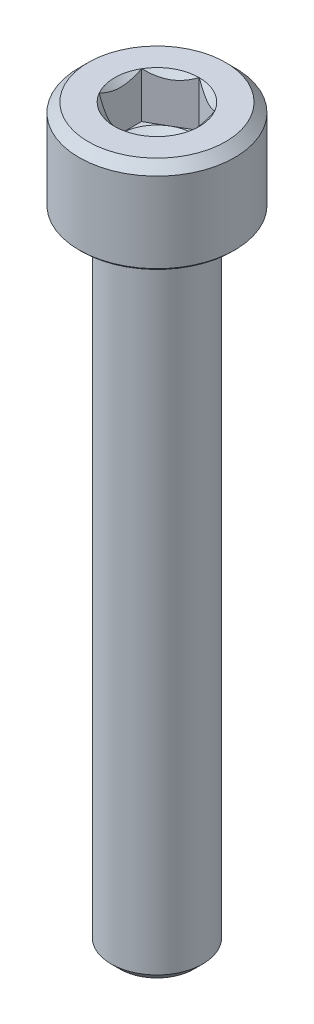
ISO-10303-21;
HEADER;
FILE_DESCRIPTION(('STEP AP214'),'2;1');
FILE_NAME('part.step','',(''),(''),'','','');
FILE_SCHEMA(('AUTOMOTIVE_DESIGN { 1 0 10303 214 1 1 1 1 }'));
ENDSEC;
DATA;
#1=APPLICATION_CONTEXT('core data for automotive mechanical design processes');
#2=APPLICATION_PROTOCOL_DEFINITION('international standard','automotive_design',2000,#1);
#3=PRODUCT_CONTEXT('',#1,'mechanical');
#4=PRODUCT('Part','Part','',(#3));
#5=PRODUCT_RELATED_PRODUCT_CATEGORY('part','',(#4));
#6=PRODUCT_DEFINITION_FORMATION('','',#4);
#7=PRODUCT_DEFINITION_CONTEXT('part definition',#1,'design');
#8=PRODUCT_DEFINITION('design','',#6,#7);
#9=PRODUCT_DEFINITION_SHAPE('','',#8);
#10=(LENGTH_UNIT() NAMED_UNIT(*) SI_UNIT(.MILLI.,.METRE.));
#11=(NAMED_UNIT(*) PLANE_ANGLE_UNIT() SI_UNIT($,.RADIAN.));
#12=(NAMED_UNIT(*) SI_UNIT($,.STERADIAN.) SOLID_ANGLE_UNIT());
#13=UNCERTAINTY_MEASURE_WITH_UNIT(LENGTH_MEASURE(1.E-05),#10,'distance_accuracy_value','');
#14=(GEOMETRIC_REPRESENTATION_CONTEXT(3) GLOBAL_UNCERTAINTY_ASSIGNED_CONTEXT((#13)) GLOBAL_UNIT_ASSIGNED_CONTEXT((#10,
#11,#12)) REPRESENTATION_CONTEXT('',''));
#15=CARTESIAN_POINT('',(0.,0.,0.));
#16=DIRECTION('',(0.,0.,1.));
#17=DIRECTION('',(1.,0.,0.));
#18=AXIS2_PLACEMENT_3D('',#15,#16,#17);
#19=CARTESIAN_POINT('',(0.,5.,0.));
#20=DIRECTION('',(0.,1.,0.));
#21=DIRECTION('',(0.,0.,1.));
#22=AXIS2_PLACEMENT_3D('',#19,#20,#21);
#23=CONICAL_SURFACE('',#22,2.3094010767585,0.785398163397454);
#24=CARTESIAN_POINT('',(0.,5.,0.));
#25=DIRECTION('',(0.,1.,0.));
#26=DIRECTION('',(0.,0.,1.));
#27=AXIS2_PLACEMENT_3D('',#24,#25,#26);
#28=CIRCLE('',#27,2.3094010767585);
#29=CARTESIAN_POINT('',(-2.,5.,-1.1547005383793));
#30=VERTEX_POINT('',#29);
#31=CARTESIAN_POINT('',(-1.99999999999995,5.,1.15470053837933));
#32=VERTEX_POINT('',#31);
#33=EDGE_CURVE('E247',#30,#32,#28,.T.);
#34=ORIENTED_EDGE('',*,*,#33,.T.);
#35=CARTESIAN_POINT('',(-2.,6.708654995211,3.48493537924179));
#36=CARTESIAN_POINT('',(-2.,6.61927874799562,3.38184597960107));
#37=CARTESIAN_POINT('',(-2.,6.53042050100161,3.27829801866237));
#38=CARTESIAN_POINT('',(-2.,6.35410938767823,3.06992943838187));
#39=CARTESIAN_POINT('',(-2.,6.26665721016997,2.96510823693146));
#40=CARTESIAN_POINT('',(-2.,6.09162252246028,2.75150553836105));
#41=CARTESIAN_POINT('',(-2.,6.00408331853335,2.64268841410051));
#42=CARTESIAN_POINT('',(-2.,5.83166422486033,2.4230012519306));
#43=CARTESIAN_POINT('',(-2.,5.74678367399898,2.31213173546714));
#44=CARTESIAN_POINT('',(-2.,5.58057752677808,2.08751128165371));
#45=CARTESIAN_POINT('',(-2.,5.49925685260331,1.97375667808639));
#46=CARTESIAN_POINT('',(-2.,5.34184669326608,1.7425008854525));
#47=CARTESIAN_POINT('',(-2.,5.26576149836544,1.6249967365224));
#48=CARTESIAN_POINT('',(-2.,5.12208771836077,1.38607583721063));
#49=CARTESIAN_POINT('',(-2.,5.05443808556477,1.26469628611464));
#50=CARTESIAN_POINT('',(-2.,4.93125075275312,1.01594779490901));
#51=CARTESIAN_POINT('',(-2.,4.8756907681709,0.888590409780953));
#52=CARTESIAN_POINT('',(-2.,4.8057129725002,0.691083080219567));
#53=CARTESIAN_POINT('',(-2.,4.78445360220782,0.623368585918429));
#54=CARTESIAN_POINT('',(-2.,4.74782417137951,0.486345144048254));
#55=CARTESIAN_POINT('',(-2.,4.73245317082739,0.417036452850191));
#56=CARTESIAN_POINT('',(-2.,4.70862178314111,0.277659447369558));
#57=CARTESIAN_POINT('',(-2.,4.70011930731512,0.207598466966292));
#58=CARTESIAN_POINT('',(-2.,4.69049074221897,0.0669670350323962));
#59=CARTESIAN_POINT('',(-2.,4.68936387797234,-0.00360336219227659));
#60=CARTESIAN_POINT('',(-2.,4.69457684389319,-0.144553783114265));
#61=CARTESIAN_POINT('',(-2.,4.70092642398598,-0.214933437991882));
#62=CARTESIAN_POINT('',(-2.,4.72062790275546,-0.354698452121302));
#63=CARTESIAN_POINT('',(-2.,4.7339811803942,-0.424083612801754));
#64=CARTESIAN_POINT('',(-2.,4.76693306790518,-0.561849214257668));
#65=CARTESIAN_POINT('',(-2.,4.78657533412026,-0.630219027882887));
#66=CARTESIAN_POINT('',(-2.,4.83104362393445,-0.765224928840642));
#67=CARTESIAN_POINT('',(-2.,4.8558697049865,-0.831860996948626));
#68=CARTESIAN_POINT('',(-2.,4.91579733674522,-0.978223263821352));
#69=CARTESIAN_POINT('',(-2.,4.9519536536689,-1.05751393733752));
#70=CARTESIAN_POINT('',(-2.,5.02908857554944,-1.2137342544637));
#71=CARTESIAN_POINT('',(-2.,5.07006996654335,-1.29066250134976));
#72=CARTESIAN_POINT('',(-2.,5.1557834307896,-1.44259332598893));
#73=CARTESIAN_POINT('',(-2.,5.20052309801058,-1.51759158443137));
#74=CARTESIAN_POINT('',(-2.,5.292817103323,-1.66580274517424));
#75=CARTESIAN_POINT('',(-2.,5.34037088158701,-1.73901599851138));
#76=CARTESIAN_POINT('',(-2.,5.43793273052157,-1.8843458006077));
#77=CARTESIAN_POINT('',(-2.,5.48795248279134,-1.95645447101702));
#78=CARTESIAN_POINT('',(-2.,5.58974868867924,-2.09942399496152));
#79=CARTESIAN_POINT('',(-2.,5.64152527469541,-2.17028475383792));
#80=CARTESIAN_POINT('',(-2.,5.79881562893298,-2.38113790846124));
#81=CARTESIAN_POINT('',(-2.,5.90641011816352,-2.51957625011767));
#82=CARTESIAN_POINT('',(-2.,6.12880481407581,-2.79793708137369));
#83=CARTESIAN_POINT('',(-2.,6.24372553752224,-2.93776233320861));
#84=CARTESIAN_POINT('',(-2.,6.41751226157034,-3.14503859467238));
#85=CARTESIAN_POINT('',(-2.,6.47535435122024,-3.21335225569831));
#86=CARTESIAN_POINT('',(-2.,6.59160375586806,-3.34949093797165));
#87=CARTESIAN_POINT('',(-2.,6.65001104087954,-3.41731598481302));
#88=CARTESIAN_POINT('',(-2.,6.708654995211,-3.48493537924179));
#89=B_SPLINE_CURVE_WITH_KNOTS('',3,(#35,#36,#37,#38,#39,#40,#41,#42,#43,#44,#45,#46,#47,#48,#49,
#50,#51,#52,#53,#54,#55,#56,#57,#58,#59,#60,#61,#62,#63,#64,#65,#66,#67,#68,#69,#70,#71,#72,#73,
#74,#75,#76,#77,#78,#79,#80,#81,#82,#83,#84,#85,#86,#87,#88),.UNSPECIFIED.,.F.,.F.,(4,2,2,2,2,2,
2,2,2,2,2,2,2,2,2,2,2,2,2,2,2,2,2,2,2,2,4),(0.,0.409325277655498,0.818845319083797,
1.23778871017889,1.65662708384644,2.0760273801686,2.49576736290815,2.91226761680366,
3.32799351692013,3.54070099927131,3.75337451094886,3.96473470800347,4.17607269648517,
4.38768659336548,4.59934217067777,4.81250006998807,5.02566033188273,5.28687426785387,
5.54823977746829,5.81014672661802,6.07200174711872,6.33524589307946,6.59850992182947,
7.12440155307799,7.66733187119036,7.93586643479272,8.20438682857141),.UNSPECIFIED.);
#90=EDGE_CURVE('E134',#32,#30,#89,.T.);
#91=ORIENTED_EDGE('',*,*,#90,.T.);
#92=EDGE_LOOP('',(#34,#91));
#93=FACE_BOUND('',#92,.T.);
#94=ADVANCED_FACE('F42',(#93),#23,.F.);
#95=CARTESIAN_POINT('',(0.,5.,-2.3094010767585));
#96=VERTEX_POINT('',#95);
#97=EDGE_CURVE('E249',#96,#30,#28,.T.);
#98=ORIENTED_EDGE('',*,*,#97,.T.);
#99=CARTESIAN_POINT('',(-2.0002,5.00011547871368,-1.15458506832546));
#100=CARTESIAN_POINT('',(-1.93144696596929,4.96045309022562,-1.19427965103069));
#101=CARTESIAN_POINT('',(-1.86154425786448,4.92311998228419,-1.23463799837209));
#102=CARTESIAN_POINT('',(-1.71900475544955,4.85476368513617,-1.3169332184615));
#103=CARTESIAN_POINT('',(-1.64635440243463,4.82377853373724,-1.35887791933138));
#104=CARTESIAN_POINT('',(-1.49985839894601,4.77070021654416,-1.44345742638074));
#105=CARTESIAN_POINT('',(-1.42605006475369,4.74847362717663,-1.48607068799511));
#106=CARTESIAN_POINT('',(-1.27680836816471,4.7142288166751,-1.57223542169507));
#107=CARTESIAN_POINT('',(-1.20137956608182,4.70218502914416,-1.61578426088227));
#108=CARTESIAN_POINT('',(-1.07138449932889,4.69131851190559,-1.6908369476654));
#109=CARTESIAN_POINT('',(-1.01698621602986,4.68970975360999,-1.72224381117155));
#110=CARTESIAN_POINT('',(-0.908278544480273,4.69241887759873,-1.78500621460368));
#111=CARTESIAN_POINT('',(-0.853969194078625,4.696738837758,-1.81636173267758));
#112=CARTESIAN_POINT('',(-0.745863272410623,4.71105956740993,-1.87877671565359));
#113=CARTESIAN_POINT('',(-0.692067343445167,4.72106669276203,-1.9098358097231));
#114=CARTESIAN_POINT('',(-0.585405737694382,4.74621243024968,-1.97141691651551));
#115=CARTESIAN_POINT('',(-0.532539989929242,4.76135064904227,-2.00193897021862));
#116=CARTESIAN_POINT('',(-0.397120266910117,4.80629450342921,-2.0801235837573));
#117=CARTESIAN_POINT('',(-0.315406165150491,4.83948883942584,-2.1273012424048));
#118=CARTESIAN_POINT('',(-0.195252962742179,4.89552582317138,-2.19667172615924));
#119=CARTESIAN_POINT('',(-0.155657147890808,4.91521470294695,-2.21953238052246));
#120=CARTESIAN_POINT('',(-0.0771990411121202,4.95638731836488,-2.26483018959124));
#121=CARTESIAN_POINT('',(-0.038336316406256,4.97786995165125,-2.28726759416161));
#122=CARTESIAN_POINT('',(0.000200000000000078,5.00011547871366,-2.30951654681234));
#123=B_SPLINE_CURVE_WITH_KNOTS('',3,(#99,#100,#101,#102,#103,#104,#105,#106,#107,#108,#109,#110,
#111,#112,#113,#114,#115,#116,#117,#118,#119,#120,#121,#122),.UNSPECIFIED.,.F.,.F.,(4,2,2,2,2,2,
2,2,2,2,2,4),(0.,0.266420613771069,0.534393751523399,0.79811037437693,1.06116288956938,
1.24939906803724,1.4377012356625,1.62621426093935,1.81471283831917,2.11415604834145,
2.26347170717789,2.41269626969768),.UNSPECIFIED.);
#124=EDGE_CURVE('E209',#30,#96,#123,.T.);
#125=ORIENTED_EDGE('',*,*,#124,.T.);
#126=EDGE_LOOP('',(#98,#125));
#127=FACE_BOUND('',#126,.T.);
#128=ADVANCED_FACE('F293',(#127),#23,.F.);
#129=CARTESIAN_POINT('',(2.,5.,-1.1547005383793));
#130=VERTEX_POINT('',#129);
#131=EDGE_CURVE('E246',#130,#96,#28,.T.);
#132=ORIENTED_EDGE('',*,*,#131,.T.);
#133=CARTESIAN_POINT('',(-0.0002,5.00011547871366,-2.30951654681234));
#134=CARTESIAN_POINT('',(0.0685530340307049,4.96045309022559,-2.26982196410711));
#135=CARTESIAN_POINT('',(0.13845574213551,4.92311998228416,-2.22946361676572));
#136=CARTESIAN_POINT('',(0.280995244550433,4.85476368513615,-2.14716839667631));
#137=CARTESIAN_POINT('',(0.353645597565354,4.82377853373723,-2.10522369580643));
#138=CARTESIAN_POINT('',(0.500141601053964,4.77070021654416,-2.02064418875708));
#139=CARTESIAN_POINT('',(0.573949935246286,4.74847362717663,-1.9780309271427));
#140=CARTESIAN_POINT('',(0.723191631835253,4.7142288166751,-1.89186619344275));
#141=CARTESIAN_POINT('',(0.798620433918139,4.70218502914416,-1.84831735425555));
#142=CARTESIAN_POINT('',(0.928615500671067,4.69131851190559,-1.77326466747242));
#143=CARTESIAN_POINT('',(0.983013783970098,4.68970975360999,-1.74185780396628));
#144=CARTESIAN_POINT('',(1.09172145551969,4.69241887759873,-1.67909540053415));
#145=CARTESIAN_POINT('',(1.14603080592133,4.696738837758,-1.64773988246024));
#146=CARTESIAN_POINT('',(1.25413672758933,4.71105956740993,-1.58532489948423));
#147=CARTESIAN_POINT('',(1.30793265655479,4.72106669276203,-1.55426580541472));
#148=CARTESIAN_POINT('',(1.41459426230557,4.74621243024969,-1.49268469862231));
#149=CARTESIAN_POINT('',(1.46746001007071,4.76135064904227,-1.4621626449192));
#150=CARTESIAN_POINT('',(1.60287973308985,4.80629450342922,-1.38397803138052));
#151=CARTESIAN_POINT('',(1.68459383484948,4.83948883942584,-1.33680037273301));
#152=CARTESIAN_POINT('',(1.8047470372578,4.8955258231714,-1.26742988897857));
#153=CARTESIAN_POINT('',(1.84434285210918,4.91521470294697,-1.24456923461535));
#154=CARTESIAN_POINT('',(1.92280095888787,4.9563873183649,-1.19927142554657));
#155=CARTESIAN_POINT('',(1.96166368359374,4.97786995165127,-1.17683402097619));
#156=CARTESIAN_POINT('',(2.0002,5.00011547871368,-1.15458506832546));
#157=B_SPLINE_CURVE_WITH_KNOTS('',3,(#133,#134,#135,#136,#137,#138,#139,#140,#141,#142,#143,
#144,#145,#146,#147,#148,#149,#150,#151,#152,#153,#154,#155,#156),.UNSPECIFIED.,.F.,.F.,(4,2,2,
2,2,2,2,2,2,2,2,4),(0.,0.266420613771056,0.534393751523372,0.798110374376888,1.06116288956933,
1.24939906803719,1.43770123566245,1.62621426093929,1.81471283831911,2.11415604834142,
2.26347170717788,2.41269626969768),.UNSPECIFIED.);
#158=EDGE_CURVE('E260',#96,#130,#157,.T.);
#159=ORIENTED_EDGE('',*,*,#158,.T.);
#160=EDGE_LOOP('',(#132,#159));
#161=FACE_BOUND('',#160,.T.);
#162=ADVANCED_FACE('F258',(#161),#23,.F.);
#163=CARTESIAN_POINT('',(2.,5.,1.1547005383793));
#164=VERTEX_POINT('',#163);
#165=EDGE_CURVE('E241',#164,#130,#28,.T.);
#166=ORIENTED_EDGE('',*,*,#165,.T.);
#167=CARTESIAN_POINT('',(2.,6.708654995211,-3.48493537924179));
#168=CARTESIAN_POINT('',(2.,6.61927874799562,-3.38184597960107));
#169=CARTESIAN_POINT('',(2.,6.53042050100161,-3.27829801866237));
#170=CARTESIAN_POINT('',(2.,6.35410938767823,-3.06992943838187));
#171=CARTESIAN_POINT('',(2.,6.26665721016997,-2.96510823693146));
#172=CARTESIAN_POINT('',(2.,6.09162252246028,-2.75150553836105));
#173=CARTESIAN_POINT('',(2.,6.00408331853335,-2.64268841410051));
#174=CARTESIAN_POINT('',(2.,5.83166422486033,-2.4230012519306));
#175=CARTESIAN_POINT('',(2.,5.74678367399898,-2.31213173546714));
#176=CARTESIAN_POINT('',(2.,5.58057752677808,-2.08751128165371));
#177=CARTESIAN_POINT('',(2.,5.49925685260331,-1.97375667808639));
#178=CARTESIAN_POINT('',(2.,5.34184669326608,-1.7425008854525));
#179=CARTESIAN_POINT('',(2.,5.26576149836544,-1.6249967365224));
#180=CARTESIAN_POINT('',(2.,5.12208771836077,-1.38607583721063));
#181=CARTESIAN_POINT('',(2.,5.05443808556477,-1.26469628611464));
#182=CARTESIAN_POINT('',(2.,4.93125075275312,-1.01594779490901));
#183=CARTESIAN_POINT('',(2.,4.8756907681709,-0.888590409780953));
#184=CARTESIAN_POINT('',(2.,4.8057129725002,-0.691083080219567));
#185=CARTESIAN_POINT('',(2.,4.78445360220782,-0.623368585918429));
#186=CARTESIAN_POINT('',(2.,4.74782417137951,-0.486345144048254));
#187=CARTESIAN_POINT('',(2.,4.73245317082739,-0.417036452850191));
#188=CARTESIAN_POINT('',(2.,4.70862178314111,-0.277659447369558));
#189=CARTESIAN_POINT('',(2.,4.70011930731512,-0.207598466966292));
#190=CARTESIAN_POINT('',(2.,4.69049074221897,-0.0669670350323962));
#191=CARTESIAN_POINT('',(2.,4.68936387797234,0.00360336219227659));
#192=CARTESIAN_POINT('',(2.,4.69457684389319,0.144553783114265));
#193=CARTESIAN_POINT('',(2.,4.70092642398598,0.214933437991882));
#194=CARTESIAN_POINT('',(2.,4.72062790275546,0.354698452121302));
#195=CARTESIAN_POINT('',(2.,4.7339811803942,0.424083612801754));
#196=CARTESIAN_POINT('',(2.,4.76693306790518,0.561849214257668));
#197=CARTESIAN_POINT('',(2.,4.78657533412026,0.630219027882887));
#198=CARTESIAN_POINT('',(2.,4.83104362393445,0.765224928840642));
#199=CARTESIAN_POINT('',(2.,4.8558697049865,0.831860996948626));
#200=CARTESIAN_POINT('',(2.,4.91579733674522,0.978223263821352));
#201=CARTESIAN_POINT('',(2.,4.9519536536689,1.05751393733752));
#202=CARTESIAN_POINT('',(2.,5.02908857554944,1.2137342544637));
#203=CARTESIAN_POINT('',(2.,5.07006996654335,1.29066250134976));
#204=CARTESIAN_POINT('',(2.,5.1557834307896,1.44259332598893));
#205=CARTESIAN_POINT('',(2.,5.20052309801058,1.51759158443137));
#206=CARTESIAN_POINT('',(2.,5.292817103323,1.66580274517424));
#207=CARTESIAN_POINT('',(2.,5.34037088158701,1.73901599851138));
#208=CARTESIAN_POINT('',(2.,5.43793273052157,1.8843458006077));
#209=CARTESIAN_POINT('',(2.,5.48795248279134,1.95645447101702));
#210=CARTESIAN_POINT('',(2.,5.58974868867924,2.09942399496152));
#211=CARTESIAN_POINT('',(2.,5.64152527469541,2.17028475383792));
#212=CARTESIAN_POINT('',(2.,5.79881562893298,2.38113790846124));
#213=CARTESIAN_POINT('',(2.,5.90641011816352,2.51957625011767));
#214=CARTESIAN_POINT('',(2.,6.12880481407581,2.79793708137369));
#215=CARTESIAN_POINT('',(2.,6.24372553752224,2.93776233320861));
#216=CARTESIAN_POINT('',(2.,6.41751226157034,3.14503859467238));
#217=CARTESIAN_POINT('',(2.,6.47535435122024,3.21335225569831));
#218=CARTESIAN_POINT('',(2.,6.59160375586806,3.34949093797165));
#219=CARTESIAN_POINT('',(2.,6.65001104087954,3.41731598481302));
#220=CARTESIAN_POINT('',(2.,6.708654995211,3.48493537924179));
#221=B_SPLINE_CURVE_WITH_KNOTS('',3,(#167,#168,#169,#170,#171,#172,#173,#174,#175,#176,#177,
#178,#179,#180,#181,#182,#183,#184,#185,#186,#187,#188,#189,#190,#191,#192,#193,#194,#195,#196,
#197,#198,#199,#200,#201,#202,#203,#204,#205,#206,#207,#208,#209,#210,#211,#212,#213,#214,#215,
#216,#217,#218,#219,#220),.UNSPECIFIED.,.F.,.F.,(4,2,2,2,2,2,2,2,2,2,2,2,2,2,2,2,2,2,2,2,2,2,2,
2,2,2,4),(0.,0.409325277655498,0.818845319083797,1.23778871017889,1.65662708384644,
2.0760273801686,2.49576736290815,2.91226761680366,3.32799351692013,3.54070099927131,
3.75337451094886,3.96473470800347,4.17607269648517,4.38768659336548,4.59934217067777,
4.81250006998807,5.02566033188273,5.28687426785387,5.54823977746829,5.81014672661802,
6.07200174711872,6.33524589307946,6.59850992182947,7.12440155307799,7.66733187119036,
7.93586643479272,8.20438682857141),.UNSPECIFIED.);
#222=EDGE_CURVE('E268',#130,#164,#221,.T.);
#223=ORIENTED_EDGE('',*,*,#222,.T.);
#224=EDGE_LOOP('',(#166,#223));
#225=FACE_BOUND('',#224,.T.);
#226=ADVANCED_FACE('F267',(#225),#23,.F.);
#227=CARTESIAN_POINT('',(0.,5.,2.3094010767585));
#228=VERTEX_POINT('',#227);
#229=EDGE_CURVE('E239',#228,#164,#28,.T.);
#230=ORIENTED_EDGE('',*,*,#229,.T.);
#231=CARTESIAN_POINT('',(2.0002,5.00011547871368,1.15458506832546));
#232=CARTESIAN_POINT('',(1.93144696596929,4.96045309022562,1.19427965103069));
#233=CARTESIAN_POINT('',(1.86154425786448,4.92311998228419,1.23463799837209));
#234=CARTESIAN_POINT('',(1.71900475544955,4.85476368513617,1.3169332184615));
#235=CARTESIAN_POINT('',(1.64635440243463,4.82377853373724,1.35887791933138));
#236=CARTESIAN_POINT('',(1.49985839894601,4.77070021654416,1.44345742638074));
#237=CARTESIAN_POINT('',(1.42605006475369,4.74847362717663,1.48607068799511));
#238=CARTESIAN_POINT('',(1.27680836816471,4.7142288166751,1.57223542169507));
#239=CARTESIAN_POINT('',(1.20137956608182,4.70218502914416,1.61578426088227));
#240=CARTESIAN_POINT('',(1.07138449932889,4.69131851190559,1.6908369476654));
#241=CARTESIAN_POINT('',(1.01698621602986,4.68970975360999,1.72224381117155));
#242=CARTESIAN_POINT('',(0.908278544480273,4.69241887759873,1.78500621460368));
#243=CARTESIAN_POINT('',(0.853969194078625,4.696738837758,1.81636173267758));
#244=CARTESIAN_POINT('',(0.745863272410623,4.71105956740993,1.87877671565359));
#245=CARTESIAN_POINT('',(0.692067343445167,4.72106669276203,1.9098358097231));
#246=CARTESIAN_POINT('',(0.585405737694382,4.74621243024968,1.97141691651551));
#247=CARTESIAN_POINT('',(0.532539989929242,4.76135064904227,2.00193897021862));
#248=CARTESIAN_POINT('',(0.397120266910117,4.80629450342921,2.0801235837573));
#249=CARTESIAN_POINT('',(0.315406165150491,4.83948883942584,2.1273012424048));
#250=CARTESIAN_POINT('',(0.195252962742179,4.89552582317138,2.19667172615924));
#251=CARTESIAN_POINT('',(0.155657147890808,4.91521470294695,2.21953238052246));
#252=CARTESIAN_POINT('',(0.0771990411121202,4.95638731836488,2.26483018959124));
#253=CARTESIAN_POINT('',(0.038336316406256,4.97786995165125,2.28726759416161));
#254=CARTESIAN_POINT('',(-0.000200000000000078,5.00011547871366,2.30951654681234));
#255=B_SPLINE_CURVE_WITH_KNOTS('',3,(#231,#232,#233,#234,#235,#236,#237,#238,#239,#240,#241,
#242,#243,#244,#245,#246,#247,#248,#249,#250,#251,#252,#253,#254),.UNSPECIFIED.,.F.,.F.,(4,2,2,
2,2,2,2,2,2,2,2,4),(0.,0.266420613771069,0.534393751523399,0.79811037437693,1.06116288956938,
1.24939906803724,1.4377012356625,1.62621426093935,1.81471283831917,2.11415604834145,
2.26347170717789,2.41269626969768),.UNSPECIFIED.);
#256=EDGE_CURVE('E178',#164,#228,#255,.T.);
#257=ORIENTED_EDGE('',*,*,#256,.T.);
#258=EDGE_LOOP('',(#230,#257));
#259=FACE_BOUND('',#258,.T.);
#260=ADVANCED_FACE('F298',(#259),#23,.F.);
#261=EDGE_CURVE('E238',#32,#228,#28,.T.);
#262=ORIENTED_EDGE('',*,*,#261,.T.);
#263=CARTESIAN_POINT('',(0.0002,5.00011547871366,2.30951654681234));
#264=CARTESIAN_POINT('',(-0.0685530340307049,4.96045309022559,2.26982196410711));
#265=CARTESIAN_POINT('',(-0.13845574213551,4.92311998228416,2.22946361676572));
#266=CARTESIAN_POINT('',(-0.280995244550433,4.85476368513615,2.14716839667631));
#267=CARTESIAN_POINT('',(-0.353645597565354,4.82377853373723,2.10522369580643));
#268=CARTESIAN_POINT('',(-0.500141601053964,4.77070021654416,2.02064418875708));
#269=CARTESIAN_POINT('',(-0.573949935246286,4.74847362717663,1.9780309271427));
#270=CARTESIAN_POINT('',(-0.723191631835253,4.7142288166751,1.89186619344275));
#271=CARTESIAN_POINT('',(-0.798620433918139,4.70218502914416,1.84831735425555));
#272=CARTESIAN_POINT('',(-0.928615500671067,4.69131851190559,1.77326466747242));
#273=CARTESIAN_POINT('',(-0.983013783970098,4.68970975360999,1.74185780396628));
#274=CARTESIAN_POINT('',(-1.09172145551969,4.69241887759873,1.67909540053415));
#275=CARTESIAN_POINT('',(-1.14603080592133,4.696738837758,1.64773988246024));
#276=CARTESIAN_POINT('',(-1.25413672758933,4.71105956740993,1.58532489948423));
#277=CARTESIAN_POINT('',(-1.30793265655479,4.72106669276203,1.55426580541472));
#278=CARTESIAN_POINT('',(-1.41459426230557,4.74621243024969,1.49268469862231));
#279=CARTESIAN_POINT('',(-1.46746001007071,4.76135064904227,1.4621626449192));
#280=CARTESIAN_POINT('',(-1.60287973308985,4.80629450342922,1.38397803138052));
#281=CARTESIAN_POINT('',(-1.68459383484948,4.83948883942584,1.33680037273301));
#282=CARTESIAN_POINT('',(-1.8047470372578,4.8955258231714,1.26742988897857));
#283=CARTESIAN_POINT('',(-1.84434285210918,4.91521470294697,1.24456923461535));
#284=CARTESIAN_POINT('',(-1.92280095888787,4.9563873183649,1.19927142554657));
#285=CARTESIAN_POINT('',(-1.96166368359374,4.97786995165127,1.17683402097619));
#286=CARTESIAN_POINT('',(-2.0002,5.00011547871368,1.15458506832546));
#287=B_SPLINE_CURVE_WITH_KNOTS('',3,(#263,#264,#265,#266,#267,#268,#269,#270,#271,#272,#273,
#274,#275,#276,#277,#278,#279,#280,#281,#282,#283,#284,#285,#286),.UNSPECIFIED.,.F.,.F.,(4,2,2,
2,2,2,2,2,2,2,2,4),(0.,0.266420613771056,0.534393751523372,0.798110374376888,1.06116288956933,
1.24939906803719,1.43770123566245,1.62621426093929,1.81471283831911,2.11415604834142,
2.26347170717788,2.41269626969768),.UNSPECIFIED.);
#288=EDGE_CURVE('E65',#228,#32,#287,.T.);
#289=ORIENTED_EDGE('',*,*,#288,.T.);
#290=EDGE_LOOP('',(#262,#289));
#291=FACE_BOUND('',#290,.T.);
#292=ADVANCED_FACE('F185',(#291),#23,.F.);
#293=CARTESIAN_POINT('',(2.3094010767585,5.,0.));
#294=DIRECTION('',(0.,-1.,0.));
#295=DIRECTION('',(0.,0.,-1.));
#296=AXIS2_PLACEMENT_3D('',#293,#294,#295);
#297=PLANE('',#296);
#298=ORIENTED_EDGE('',*,*,#229,.F.);
#299=ORIENTED_EDGE('',*,*,#261,.F.);
#300=ORIENTED_EDGE('',*,*,#33,.F.);
#301=ORIENTED_EDGE('',*,*,#97,.F.);
#302=ORIENTED_EDGE('',*,*,#131,.F.);
#303=ORIENTED_EDGE('',*,*,#165,.F.);
#304=EDGE_LOOP('',(#298,#299,#300,#301,#302,#303));
#305=FACE_BOUND('',#304,.T.);
#306=CARTESIAN_POINT('',(0.,5.,0.));
#307=DIRECTION('',(0.,1.,0.));
#308=DIRECTION('',(0.,0.,1.));
#309=AXIS2_PLACEMENT_3D('',#306,#307,#308);
#310=CIRCLE('',#309,3.75);
#311=CARTESIAN_POINT('',(0.,5.,3.75));
#312=VERTEX_POINT('',#311);
#313=EDGE_CURVE('E236',#312,#312,#310,.T.);
#314=ORIENTED_EDGE('',*,*,#313,.T.);
#315=EDGE_LOOP('',(#314));
#316=FACE_BOUND('',#315,.T.);
#317=ADVANCED_FACE('F264',(#305,#316),#297,.F.);
#318=CARTESIAN_POINT('',(0.,4.5,0.));
#319=DIRECTION('',(0.,-1.,0.));
#320=DIRECTION('',(0.,0.,-1.));
#321=AXIS2_PLACEMENT_3D('',#318,#319,#320);
#322=CONICAL_SURFACE('',#321,4.25,0.785398163397455);
#323=ORIENTED_EDGE('',*,*,#313,.F.);
#324=EDGE_LOOP('',(#323));
#325=FACE_BOUND('',#324,.T.);
#326=CARTESIAN_POINT('',(0.,4.5,0.));
#327=DIRECTION('',(0.,1.,0.));
#328=DIRECTION('',(0.,0.,1.));
#329=AXIS2_PLACEMENT_3D('',#326,#327,#328);
#330=CIRCLE('',#329,4.25);
#331=CARTESIAN_POINT('',(0.,4.5,4.25));
#332=VERTEX_POINT('',#331);
#333=EDGE_CURVE('E233',#332,#332,#330,.T.);
#334=ORIENTED_EDGE('',*,*,#333,.T.);
#335=EDGE_LOOP('',(#334));
#336=FACE_BOUND('',#335,.T.);
#337=ADVANCED_FACE('F303',(#325,#336),#322,.T.);
#338=CARTESIAN_POINT('',(0.,-35.,0.));
#339=DIRECTION('',(0.,1.,0.));
#340=DIRECTION('',(0.,0.,1.));
#341=AXIS2_PLACEMENT_3D('',#338,#339,#340);
#342=CYLINDRICAL_SURFACE('',#341,4.25);
#343=ORIENTED_EDGE('',*,*,#333,.F.);
#344=EDGE_LOOP('',(#343));
#345=FACE_BOUND('',#344,.T.);
#346=CARTESIAN_POINT('',(0.,0.125,0.));
#347=DIRECTION('',(0.,1.,0.));
#348=DIRECTION('',(0.,0.,1.));
#349=AXIS2_PLACEMENT_3D('',#346,#347,#348);
#350=CIRCLE('',#349,4.25);
#351=CARTESIAN_POINT('',(0.,0.125,4.25));
#352=VERTEX_POINT('',#351);
#353=EDGE_CURVE('E230',#352,#352,#350,.T.);
#354=ORIENTED_EDGE('',*,*,#353,.T.);
#355=EDGE_LOOP('',(#354));
#356=FACE_BOUND('',#355,.T.);
#357=ADVANCED_FACE('F381',(#345,#356),#342,.T.);
#358=CARTESIAN_POINT('',(0.,0.,0.));
#359=DIRECTION('',(0.,1.,0.));
#360=DIRECTION('',(0.,0.,1.));
#361=AXIS2_PLACEMENT_3D('',#358,#359,#360);
#362=CONICAL_SURFACE('',#361,4.125,0.785398163397448);
#363=ORIENTED_EDGE('',*,*,#353,.F.);
#364=EDGE_LOOP('',(#363));
#365=FACE_BOUND('',#364,.T.);
#366=CARTESIAN_POINT('',(0.,0.,0.));
#367=DIRECTION('',(0.,1.,0.));
#368=DIRECTION('',(0.,0.,1.));
#369=AXIS2_PLACEMENT_3D('',#366,#367,#368);
#370=CIRCLE('',#369,4.125);
#371=CARTESIAN_POINT('',(0.,0.,4.125));
#372=VERTEX_POINT('',#371);
#373=EDGE_CURVE('E227',#372,#372,#370,.T.);
#374=ORIENTED_EDGE('',*,*,#373,.T.);
#375=EDGE_LOOP('',(#374));
#376=FACE_BOUND('',#375,.T.);
#377=ADVANCED_FACE('F385',(#365,#376),#362,.T.);
#378=CARTESIAN_POINT('',(4.125,0.,0.));
#379=DIRECTION('',(0.,1.,0.));
#380=DIRECTION('',(0.,0.,1.));
#381=AXIS2_PLACEMENT_3D('',#378,#379,#380);
#382=PLANE('',#381);
#383=ORIENTED_EDGE('',*,*,#373,.F.);
#384=EDGE_LOOP('',(#383));
#385=FACE_BOUND('',#384,.T.);
#386=CARTESIAN_POINT('',(0.,0.,0.));
#387=DIRECTION('',(0.,1.,0.));
#388=DIRECTION('',(0.,0.,1.));
#389=AXIS2_PLACEMENT_3D('',#386,#387,#388);
#390=CIRCLE('',#389,2.55);
#391=CARTESIAN_POINT('',(0.,0.,2.55));
#392=VERTEX_POINT('',#391);
#393=EDGE_CURVE('E224',#392,#392,#390,.T.);
#394=ORIENTED_EDGE('',*,*,#393,.T.);
#395=EDGE_LOOP('',(#394));
#396=FACE_BOUND('',#395,.T.);
#397=ADVANCED_FACE('F442',(#385,#396),#382,.F.);
#398=CARTESIAN_POINT('',(0.,-0.600000000000003,0.));
#399=DIRECTION('',(0.,1.,0.));
#400=DIRECTION('',(0.,0.,1.));
#401=AXIS2_PLACEMENT_3D('',#398,#399,#400);
#402=CONICAL_SURFACE('',#401,2.5,0.0831412318884403);
#403=ORIENTED_EDGE('',*,*,#393,.F.);
#404=EDGE_LOOP('',(#403));
#405=FACE_BOUND('',#404,.T.);
#406=CARTESIAN_POINT('',(0.,-0.600000000000003,0.));
#407=DIRECTION('',(0.,1.,0.));
#408=DIRECTION('',(0.,0.,1.));
#409=AXIS2_PLACEMENT_3D('',#406,#407,#408);
#410=CIRCLE('',#409,2.5);
#411=CARTESIAN_POINT('',(0.,-0.600000000000003,2.5));
#412=VERTEX_POINT('',#411);
#413=EDGE_CURVE('E221',#412,#412,#410,.T.);
#414=ORIENTED_EDGE('',*,*,#413,.T.);
#415=EDGE_LOOP('',(#414));
#416=FACE_BOUND('',#415,.T.);
#417=ADVANCED_FACE('F431',(#405,#416),#402,.T.);
#418=CARTESIAN_POINT('',(0.,-35.,0.));
#419=DIRECTION('',(0.,1.,0.));
#420=DIRECTION('',(0.,0.,1.));
#421=AXIS2_PLACEMENT_3D('',#418,#419,#420);
#422=CYLINDRICAL_SURFACE('',#421,2.5);
#423=ORIENTED_EDGE('',*,*,#413,.F.);
#424=EDGE_LOOP('',(#423));
#425=FACE_BOUND('',#424,.T.);
#426=CARTESIAN_POINT('',(0.,-34.5095,0.));
#427=DIRECTION('',(0.,1.,0.));
#428=DIRECTION('',(0.,0.,1.));
#429=AXIS2_PLACEMENT_3D('',#426,#427,#428);
#430=CIRCLE('',#429,2.5);
#431=CARTESIAN_POINT('',(0.,-34.5095,2.5));
#432=VERTEX_POINT('',#431);
#433=EDGE_CURVE('E218',#432,#432,#430,.T.);
#434=ORIENTED_EDGE('',*,*,#433,.T.);
#435=EDGE_LOOP('',(#434));
#436=FACE_BOUND('',#435,.T.);
#437=ADVANCED_FACE('F324',(#425,#436),#422,.T.);
#438=CARTESIAN_POINT('',(0.,-35.,0.));
#439=DIRECTION('',(0.,1.,0.));
#440=DIRECTION('',(0.,0.,1.));
#441=AXIS2_PLACEMENT_3D('',#438,#439,#440);
#442=CONICAL_SURFACE('',#441,2.0095,0.78539816339745);
#443=ORIENTED_EDGE('',*,*,#433,.F.);
#444=EDGE_LOOP('',(#443));
#445=FACE_BOUND('',#444,.T.);
#446=CARTESIAN_POINT('',(0.,-35.,0.));
#447=DIRECTION('',(0.,1.,0.));
#448=DIRECTION('',(0.,0.,1.));
#449=AXIS2_PLACEMENT_3D('',#446,#447,#448);
#450=CIRCLE('',#449,2.0095);
#451=CARTESIAN_POINT('',(0.,-35.,2.0095));
#452=VERTEX_POINT('',#451);
#453=EDGE_CURVE('E208',#452,#452,#450,.T.);
#454=ORIENTED_EDGE('',*,*,#453,.T.);
#455=EDGE_LOOP('',(#454));
#456=FACE_BOUND('',#455,.T.);
#457=ADVANCED_FACE('F407',(#445,#456),#442,.T.);
#458=CARTESIAN_POINT('',(2.0095,-35.,0.));
#459=DIRECTION('',(0.,1.,0.));
#460=DIRECTION('',(0.,0.,1.));
#461=AXIS2_PLACEMENT_3D('',#458,#459,#460);
#462=PLANE('',#461);
#463=ORIENTED_EDGE('',*,*,#453,.F.);
#464=EDGE_LOOP('',(#463));
#465=FACE_BOUND('',#464,.T.);
#466=ADVANCED_FACE('F199',(#465),#462,.F.);
#467=CARTESIAN_POINT('',(0.,2.5,0.));
#468=DIRECTION('',(0.,1.,0.));
#469=DIRECTION('',(0.,0.,1.));
#470=AXIS2_PLACEMENT_3D('',#467,#468,#469);
#471=PLANE('',#470);
#472=CARTESIAN_POINT('',(0.,2.5,0.));
#473=DIRECTION('',(0.,1.,0.));
#474=DIRECTION('',(0.,0.,1.));
#475=AXIS2_PLACEMENT_3D('',#472,#473,#474);
#476=CIRCLE('',#475,2.);
#477=CARTESIAN_POINT('',(-2.,2.5,0.));
#478=VERTEX_POINT('',#477);
#479=CARTESIAN_POINT('',(-0.999999999999976,2.5,1.73205080756891));
#480=VERTEX_POINT('',#479);
#481=EDGE_CURVE('E124',#478,#480,#476,.T.);
#482=ORIENTED_EDGE('',*,*,#481,.F.);
#483=DIRECTION('',(0.,0.,1.));
#484=VECTOR('',#483,1.);
#485=CARTESIAN_POINT('',(-2.,2.5,-1.1547005383793));
#486=LINE('',#485,#484);
#487=CARTESIAN_POINT('',(-2.,2.5,1.1547005383793));
#488=VERTEX_POINT('',#487);
#489=EDGE_CURVE('E118',#478,#488,#486,.T.);
#490=ORIENTED_EDGE('',*,*,#489,.T.);
#491=DIRECTION('',(0.866025403784448,0.,0.499999999999983));
#492=VECTOR('',#491,1.);
#493=CARTESIAN_POINT('',(-2.,2.5,1.1547005383793));
#494=LINE('',#493,#492);
#495=EDGE_CURVE('E122',#488,#480,#494,.T.);
#496=ORIENTED_EDGE('',*,*,#495,.T.);
#497=EDGE_LOOP('',(#482,#490,#496));
#498=FACE_BOUND('',#497,.T.);
#499=ADVANCED_FACE('F120',(#498),#471,.T.);
#500=CARTESIAN_POINT('',(-0.999999999999976,2.5,-1.73205080756891));
#501=VERTEX_POINT('',#500);
#502=EDGE_CURVE('E532',#501,#478,#476,.T.);
#503=ORIENTED_EDGE('',*,*,#502,.F.);
#504=DIRECTION('',(-0.866025403784448,0.,0.499999999999983));
#505=VECTOR('',#504,1.);
#506=CARTESIAN_POINT('',(0.,2.5,-2.3094010767585));
#507=LINE('',#506,#505);
#508=CARTESIAN_POINT('',(-2.,2.5,-1.1547005383793));
#509=VERTEX_POINT('',#508);
#510=EDGE_CURVE('E156',#501,#509,#507,.T.);
#511=ORIENTED_EDGE('',*,*,#510,.T.);
#512=EDGE_CURVE('E128',#509,#478,#486,.T.);
#513=ORIENTED_EDGE('',*,*,#512,.T.);
#514=EDGE_LOOP('',(#503,#511,#513));
#515=FACE_BOUND('',#514,.T.);
#516=ADVANCED_FACE('F291',(#515),#471,.T.);
#517=CARTESIAN_POINT('',(0.999999999999976,2.5,-1.73205080756891));
#518=VERTEX_POINT('',#517);
#519=EDGE_CURVE('E531',#518,#501,#476,.T.);
#520=ORIENTED_EDGE('',*,*,#519,.F.);
#521=DIRECTION('',(-0.866025403784448,0.,-0.499999999999983));
#522=VECTOR('',#521,1.);
#523=CARTESIAN_POINT('',(2.,2.5,-1.1547005383793));
#524=LINE('',#523,#522);
#525=CARTESIAN_POINT('',(0.,2.5,-2.3094010767585));
#526=VERTEX_POINT('',#525);
#527=EDGE_CURVE('E152',#518,#526,#524,.T.);
#528=ORIENTED_EDGE('',*,*,#527,.T.);
#529=EDGE_CURVE('E138',#526,#501,#507,.T.);
#530=ORIENTED_EDGE('',*,*,#529,.T.);
#531=EDGE_LOOP('',(#520,#528,#530));
#532=FACE_BOUND('',#531,.T.);
#533=ADVANCED_FACE('F476',(#532),#471,.T.);
#534=CARTESIAN_POINT('',(2.,2.5,0.));
#535=VERTEX_POINT('',#534);
#536=EDGE_CURVE('E50',#535,#518,#476,.T.);
#537=ORIENTED_EDGE('',*,*,#536,.F.);
#538=DIRECTION('',(0.,0.,-1.));
#539=VECTOR('',#538,1.);
#540=CARTESIAN_POINT('',(2.,2.5,1.1547005383793));
#541=LINE('',#540,#539);
#542=CARTESIAN_POINT('',(2.,2.5,-1.1547005383793));
#543=VERTEX_POINT('',#542);
#544=EDGE_CURVE('E148',#535,#543,#541,.T.);
#545=ORIENTED_EDGE('',*,*,#544,.T.);
#546=EDGE_CURVE('E153',#543,#518,#524,.T.);
#547=ORIENTED_EDGE('',*,*,#546,.T.);
#548=EDGE_LOOP('',(#537,#545,#547));
#549=FACE_BOUND('',#548,.T.);
#550=ADVANCED_FACE('F289',(#549),#471,.T.);
#551=CARTESIAN_POINT('',(0.999999999999966,2.5,1.7320508075689));
#552=VERTEX_POINT('',#551);
#553=EDGE_CURVE('E11',#552,#535,#476,.T.);
#554=ORIENTED_EDGE('',*,*,#553,.F.);
#555=DIRECTION('',(0.866025403784448,0.,-0.499999999999983));
#556=VECTOR('',#555,1.);
#557=CARTESIAN_POINT('',(0.,2.5,2.3094010767585));
#558=LINE('',#557,#556);
#559=CARTESIAN_POINT('',(2.,2.5,1.1547005383793));
#560=VERTEX_POINT('',#559);
#561=EDGE_CURVE('E144',#552,#560,#558,.T.);
#562=ORIENTED_EDGE('',*,*,#561,.T.);
#563=EDGE_CURVE('E149',#560,#535,#541,.T.);
#564=ORIENTED_EDGE('',*,*,#563,.T.);
#565=EDGE_LOOP('',(#554,#562,#564));
#566=FACE_BOUND('',#565,.T.);
#567=ADVANCED_FACE('F279',(#566),#471,.T.);
#568=EDGE_CURVE('E51',#480,#552,#476,.T.);
#569=ORIENTED_EDGE('',*,*,#568,.F.);
#570=CARTESIAN_POINT('',(0.,2.5,2.3094010767585));
#571=VERTEX_POINT('',#570);
#572=EDGE_CURVE('E143',#480,#571,#494,.T.);
#573=ORIENTED_EDGE('',*,*,#572,.T.);
#574=EDGE_CURVE('E58',#571,#552,#558,.T.);
#575=ORIENTED_EDGE('',*,*,#574,.T.);
#576=EDGE_LOOP('',(#569,#573,#575));
#577=FACE_BOUND('',#576,.T.);
#578=ADVANCED_FACE('F198',(#577),#471,.T.);
#579=CARTESIAN_POINT('',(-2.,2.5,-1.1547005383793));
#580=DIRECTION('',(-1.,0.,0.));
#581=DIRECTION('',(0.,0.,1.));
#582=AXIS2_PLACEMENT_3D('',#579,#580,#581);
#583=PLANE('',#582);
#584=ORIENTED_EDGE('',*,*,#90,.F.);
#585=DIRECTION('',(0.,1.,0.));
#586=VECTOR('',#585,1.);
#587=CARTESIAN_POINT('',(-2.,2.5,1.1547005383793));
#588=LINE('',#587,#586);
#589=EDGE_CURVE('E131',#488,#32,#588,.T.);
#590=ORIENTED_EDGE('',*,*,#589,.F.);
#591=ORIENTED_EDGE('',*,*,#489,.F.);
#592=ORIENTED_EDGE('',*,*,#512,.F.);
#593=DIRECTION('',(0.,1.,0.));
#594=VECTOR('',#593,1.);
#595=CARTESIAN_POINT('',(-2.,2.5,-1.1547005383793));
#596=LINE('',#595,#594);
#597=EDGE_CURVE('E159',#509,#30,#596,.T.);
#598=ORIENTED_EDGE('',*,*,#597,.T.);
#599=EDGE_LOOP('',(#584,#590,#591,#592,#598));
#600=FACE_BOUND('',#599,.T.);
#601=ADVANCED_FACE('F132',(#600),#583,.F.);
#602=CARTESIAN_POINT('',(0.,2.5,-2.3094010767585));
#603=DIRECTION('',(-0.499999999999983,0.,-0.866025403784448));
#604=DIRECTION('',(-0.866025403784448,0.,0.499999999999983));
#605=AXIS2_PLACEMENT_3D('',#602,#603,#604);
#606=PLANE('',#605);
#607=ORIENTED_EDGE('',*,*,#124,.F.);
#608=ORIENTED_EDGE('',*,*,#597,.F.);
#609=ORIENTED_EDGE('',*,*,#510,.F.);
#610=ORIENTED_EDGE('',*,*,#529,.F.);
#611=DIRECTION('',(0.,1.,0.));
#612=VECTOR('',#611,1.);
#613=CARTESIAN_POINT('',(0.,2.5,-2.3094010767585));
#614=LINE('',#613,#612);
#615=EDGE_CURVE('E161',#526,#96,#614,.T.);
#616=ORIENTED_EDGE('',*,*,#615,.T.);
#617=EDGE_LOOP('',(#607,#608,#609,#610,#616));
#618=FACE_BOUND('',#617,.T.);
#619=ADVANCED_FACE('F197',(#618),#606,.F.);
#620=CARTESIAN_POINT('',(2.,2.5,-1.1547005383793));
#621=DIRECTION('',(0.499999999999983,0.,-0.866025403784448));
#622=DIRECTION('',(-0.866025403784448,0.,-0.499999999999983));
#623=AXIS2_PLACEMENT_3D('',#620,#621,#622);
#624=PLANE('',#623);
#625=ORIENTED_EDGE('',*,*,#158,.F.);
#626=ORIENTED_EDGE('',*,*,#615,.F.);
#627=ORIENTED_EDGE('',*,*,#527,.F.);
#628=ORIENTED_EDGE('',*,*,#546,.F.);
#629=DIRECTION('',(0.,1.,0.));
#630=VECTOR('',#629,1.);
#631=CARTESIAN_POINT('',(2.,2.5,-1.1547005383793));
#632=LINE('',#631,#630);
#633=EDGE_CURVE('E164',#543,#130,#632,.T.);
#634=ORIENTED_EDGE('',*,*,#633,.T.);
#635=EDGE_LOOP('',(#625,#626,#627,#628,#634));
#636=FACE_BOUND('',#635,.T.);
#637=ADVANCED_FACE('F331',(#636),#624,.F.);
#638=CARTESIAN_POINT('',(2.,2.5,1.1547005383793));
#639=DIRECTION('',(1.,0.,0.));
#640=DIRECTION('',(0.,0.,-1.));
#641=AXIS2_PLACEMENT_3D('',#638,#639,#640);
#642=PLANE('',#641);
#643=ORIENTED_EDGE('',*,*,#222,.F.);
#644=ORIENTED_EDGE('',*,*,#633,.F.);
#645=ORIENTED_EDGE('',*,*,#544,.F.);
#646=ORIENTED_EDGE('',*,*,#563,.F.);
#647=DIRECTION('',(0.,1.,0.));
#648=VECTOR('',#647,1.);
#649=CARTESIAN_POINT('',(2.,2.5,1.1547005383793));
#650=LINE('',#649,#648);
#651=EDGE_CURVE('E167',#560,#164,#650,.T.);
#652=ORIENTED_EDGE('',*,*,#651,.T.);
#653=EDGE_LOOP('',(#643,#644,#645,#646,#652));
#654=FACE_BOUND('',#653,.T.);
#655=ADVANCED_FACE('F275',(#654),#642,.F.);
#656=CARTESIAN_POINT('',(0.,2.5,2.3094010767585));
#657=DIRECTION('',(0.499999999999983,0.,0.866025403784448));
#658=DIRECTION('',(0.866025403784448,0.,-0.499999999999983));
#659=AXIS2_PLACEMENT_3D('',#656,#657,#658);
#660=PLANE('',#659);
#661=ORIENTED_EDGE('',*,*,#256,.F.);
#662=ORIENTED_EDGE('',*,*,#651,.F.);
#663=ORIENTED_EDGE('',*,*,#561,.F.);
#664=ORIENTED_EDGE('',*,*,#574,.F.);
#665=DIRECTION('',(0.,1.,0.));
#666=VECTOR('',#665,1.);
#667=CARTESIAN_POINT('',(0.,2.5,2.3094010767585));
#668=LINE('',#667,#666);
#669=EDGE_CURVE('E137',#571,#228,#668,.T.);
#670=ORIENTED_EDGE('',*,*,#669,.T.);
#671=EDGE_LOOP('',(#661,#662,#663,#664,#670));
#672=FACE_BOUND('',#671,.T.);
#673=ADVANCED_FACE('F191',(#672),#660,.F.);
#674=CARTESIAN_POINT('',(-2.,2.5,1.1547005383793));
#675=DIRECTION('',(-0.499999999999983,0.,0.866025403784448));
#676=DIRECTION('',(0.866025403784448,0.,0.499999999999983));
#677=AXIS2_PLACEMENT_3D('',#674,#675,#676);
#678=PLANE('',#677);
#679=ORIENTED_EDGE('',*,*,#288,.F.);
#680=ORIENTED_EDGE('',*,*,#669,.F.);
#681=ORIENTED_EDGE('',*,*,#572,.F.);
#682=ORIENTED_EDGE('',*,*,#495,.F.);
#683=ORIENTED_EDGE('',*,*,#589,.T.);
#684=EDGE_LOOP('',(#679,#680,#681,#682,#683));
#685=FACE_BOUND('',#684,.T.);
#686=ADVANCED_FACE('F141',(#685),#678,.F.);
#687=CARTESIAN_POINT('',(0.,2.5,0.));
#688=DIRECTION('',(0.,1.,0.));
#689=DIRECTION('',(0.,0.,1.));
#690=AXIS2_PLACEMENT_3D('',#687,#688,#689);
#691=CONICAL_SURFACE('',#690,2.,1.04719755119658);
#692=CARTESIAN_POINT('',(0.,1.3452994616207,0.));
#693=VERTEX_POINT('',#692);
#694=VERTEX_LOOP('',#693);
#695=FACE_BOUND('',#694,.T.);
#696=ORIENTED_EDGE('',*,*,#553,.T.);
#697=ORIENTED_EDGE('',*,*,#536,.T.);
#698=ORIENTED_EDGE('',*,*,#519,.T.);
#699=ORIENTED_EDGE('',*,*,#502,.T.);
#700=ORIENTED_EDGE('',*,*,#481,.T.);
#701=ORIENTED_EDGE('',*,*,#568,.T.);
#702=EDGE_LOOP('',(#696,#697,#698,#699,#700,#701));
#703=FACE_BOUND('',#702,.T.);
#704=ADVANCED_FACE('F44',(#695,#703),#691,.F.);
#705=CLOSED_SHELL('',(#94,#128,#162,#226,#260,#292,#317,#337,#357,#377,#397,#417,#437,#457,#466,
#499,#516,#533,#550,#567,#578,#601,#619,#637,#655,#673,#686,#704));
#706=MANIFOLD_SOLID_BREP('B2',#705);
#707=ADVANCED_BREP_SHAPE_REPRESENTATION('',(#18,#706),#14);
#708=SHAPE_DEFINITION_REPRESENTATION(#9,#707);
ENDSEC;
END-ISO-10303-21;
